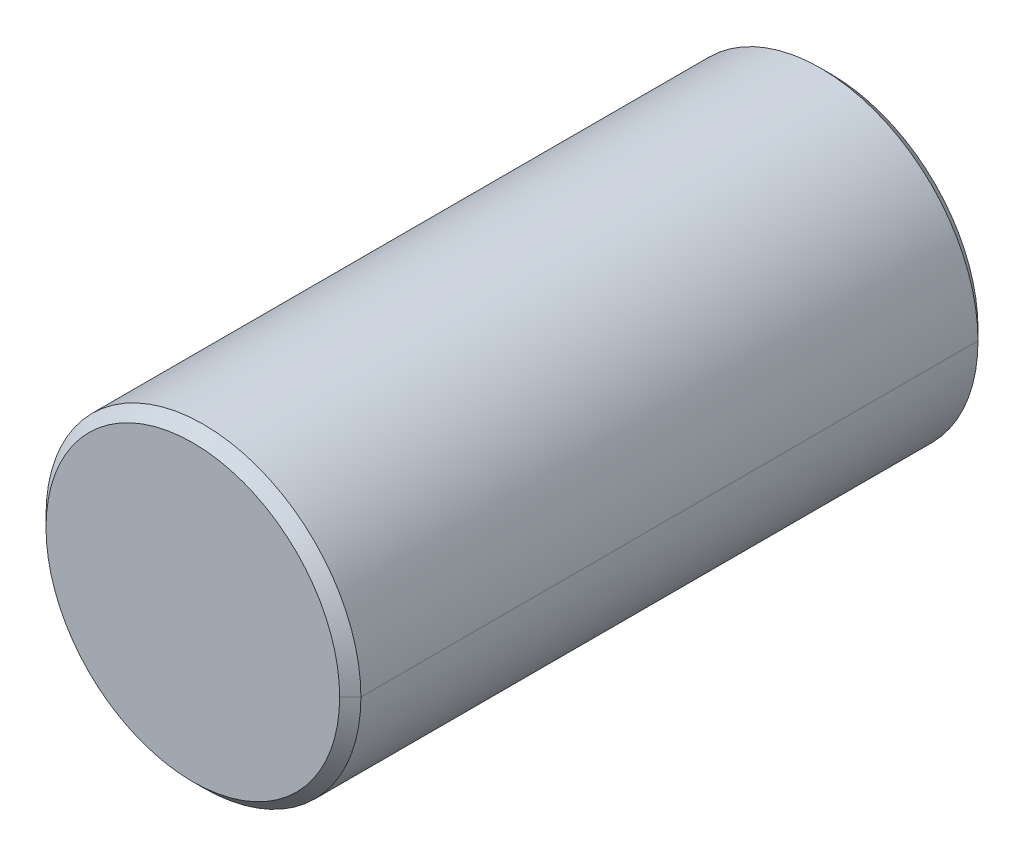
ISO-10303-21;
HEADER;
FILE_DESCRIPTION(('STEP AP214'),'2;1');
FILE_NAME('part.step','',(''),(''),'','','');
FILE_SCHEMA(('AUTOMOTIVE_DESIGN { 1 0 10303 214 1 1 1 1 }'));
ENDSEC;
DATA;
#1=APPLICATION_CONTEXT('core data for automotive mechanical design processes');
#2=APPLICATION_PROTOCOL_DEFINITION('international standard','automotive_design',2000,#1);
#3=PRODUCT_CONTEXT('',#1,'mechanical');
#4=PRODUCT('Part','Part','',(#3));
#5=PRODUCT_RELATED_PRODUCT_CATEGORY('part','',(#4));
#6=PRODUCT_DEFINITION_FORMATION('','',#4);
#7=PRODUCT_DEFINITION_CONTEXT('part definition',#1,'design');
#8=PRODUCT_DEFINITION('design','',#6,#7);
#9=PRODUCT_DEFINITION_SHAPE('','',#8);
#10=(LENGTH_UNIT() NAMED_UNIT(*) SI_UNIT(.MILLI.,.METRE.));
#11=(NAMED_UNIT(*) PLANE_ANGLE_UNIT() SI_UNIT($,.RADIAN.));
#12=(NAMED_UNIT(*) SI_UNIT($,.STERADIAN.) SOLID_ANGLE_UNIT());
#13=UNCERTAINTY_MEASURE_WITH_UNIT(LENGTH_MEASURE(1.E-05),#10,'distance_accuracy_value','');
#14=(GEOMETRIC_REPRESENTATION_CONTEXT(3) GLOBAL_UNCERTAINTY_ASSIGNED_CONTEXT((#13)) GLOBAL_UNIT_ASSIGNED_CONTEXT((#10,
#11,#12)) REPRESENTATION_CONTEXT('',''));
#15=CARTESIAN_POINT('',(0.,0.,0.));
#16=DIRECTION('',(0.,0.,1.));
#17=DIRECTION('',(1.,0.,0.));
#18=AXIS2_PLACEMENT_3D('',#15,#16,#17);
#19=CARTESIAN_POINT('',(0.,0.,-2.));
#20=DIRECTION('',(0.,0.,1.));
#21=DIRECTION('',(1.,0.,0.));
#22=AXIS2_PLACEMENT_3D('',#19,#20,#21);
#23=CYLINDRICAL_SURFACE('',#22,0.74);
#24=DIRECTION('',(0.,0.,-1.));
#25=VECTOR('',#24,1.);
#26=CARTESIAN_POINT('',(0.74,8.986054695829E-10,0.95));
#27=LINE('',#26,#25);
#28=CARTESIAN_POINT('',(0.74,0.,0.95));
#29=VERTEX_POINT('',#28);
#30=CARTESIAN_POINT('',(0.7400000000001,8.986052599583E-10,-1.95));
#31=VERTEX_POINT('',#30);
#32=EDGE_CURVE('E87',#29,#31,#27,.T.);
#33=ORIENTED_EDGE('',*,*,#32,.T.);
#34=CARTESIAN_POINT('',(0.,0.,-1.95));
#35=DIRECTION('',(0.,0.,1.));
#36=DIRECTION('',(1.,0.,0.));
#37=AXIS2_PLACEMENT_3D('',#34,#35,#36);
#38=CIRCLE('',#37,0.7400000000003);
#39=CARTESIAN_POINT('',(0.,0.7400000000003,-1.95));
#40=VERTEX_POINT('',#39);
#41=EDGE_CURVE('E157',#31,#40,#38,.T.);
#42=ORIENTED_EDGE('',*,*,#41,.T.);
#43=CARTESIAN_POINT('',(0.,0.,-1.95));
#44=DIRECTION('',(0.,0.,1.));
#45=DIRECTION('',(0.,1.,0.));
#46=AXIS2_PLACEMENT_3D('',#43,#44,#45);
#47=CIRCLE('',#46,0.7400000000003);
#48=CARTESIAN_POINT('',(-0.7400000000003,-1.547337145495E-09,-1.95));
#49=VERTEX_POINT('',#48);
#50=EDGE_CURVE('E161',#40,#49,#47,.T.);
#51=ORIENTED_EDGE('',*,*,#50,.T.);
#52=DIRECTION('',(0.,0.,-1.));
#53=VECTOR('',#52,1.);
#54=CARTESIAN_POINT('',(-0.74,-1.672273923329E-09,0.95));
#55=LINE('',#54,#53);
#56=CARTESIAN_POINT('',(-0.74,-1.547337145495E-09,0.95));
#57=VERTEX_POINT('',#56);
#58=EDGE_CURVE('E120',#57,#49,#55,.T.);
#59=ORIENTED_EDGE('',*,*,#58,.F.);
#60=CARTESIAN_POINT('',(0.,0.,0.95));
#61=DIRECTION('',(0.,0.,-1.));
#62=DIRECTION('',(-1.,-2.09099614256E-09,0.));
#63=AXIS2_PLACEMENT_3D('',#60,#61,#62);
#64=CIRCLE('',#63,0.74);
#65=CARTESIAN_POINT('',(0.,0.74,0.95));
#66=VERTEX_POINT('',#65);
#67=EDGE_CURVE('E11',#57,#66,#64,.T.);
#68=ORIENTED_EDGE('',*,*,#67,.T.);
#69=CARTESIAN_POINT('',(0.,0.,0.95));
#70=DIRECTION('',(0.,0.,-1.));
#71=DIRECTION('',(0.,1.,0.));
#72=AXIS2_PLACEMENT_3D('',#69,#70,#71);
#73=CIRCLE('',#72,0.74);
#74=EDGE_CURVE('E20',#66,#29,#73,.T.);
#75=ORIENTED_EDGE('',*,*,#74,.T.);
#76=EDGE_LOOP('',(#33,#42,#51,#59,#68,#75));
#77=FACE_BOUND('',#76,.T.);
#78=ADVANCED_FACE('F17',(#77),#23,.T.);
#79=CARTESIAN_POINT('',(0.,0.,0.975));
#80=DIRECTION('',(0.,0.,-1.));
#81=DIRECTION('',(0.,-1.,0.));
#82=AXIS2_PLACEMENT_3D('',#79,#80,#81);
#83=CONICAL_SURFACE('',#82,0.715,0.7853981633973);
#84=DIRECTION('',(-0.707106781186598,3.09118448420199E-09,0.707106781186498));
#85=VECTOR('',#84,1.);
#86=CARTESIAN_POINT('',(0.74,8.986054695829E-10,0.95));
#87=LINE('',#86,#85);
#88=CARTESIAN_POINT('',(0.69,0.,1.));
#89=VERTEX_POINT('',#88);
#90=EDGE_CURVE('E93',#29,#89,#87,.T.);
#91=ORIENTED_EDGE('',*,*,#90,.F.);
#92=ORIENTED_EDGE('',*,*,#74,.F.);
#93=ORIENTED_EDGE('',*,*,#67,.F.);
#94=DIRECTION('',(0.707106781186598,7.85014260544997E-09,0.707106781186498));
#95=VECTOR('',#94,1.);
#96=CARTESIAN_POINT('',(-0.74,-1.672273923329E-09,0.95));
#97=LINE('',#96,#95);
#98=CARTESIAN_POINT('',(-0.69,0.,1.));
#99=VERTEX_POINT('',#98);
#100=EDGE_CURVE('E103',#57,#99,#97,.T.);
#101=ORIENTED_EDGE('',*,*,#100,.T.);
#102=CARTESIAN_POINT('',(0.,0.,1.));
#103=DIRECTION('',(0.,0.,-1.));
#104=DIRECTION('',(-1.,0.,0.));
#105=AXIS2_PLACEMENT_3D('',#102,#103,#104);
#106=CIRCLE('',#105,0.69);
#107=CARTESIAN_POINT('',(0.,0.69,1.));
#108=VERTEX_POINT('',#107);
#109=EDGE_CURVE('E91',#99,#108,#106,.T.);
#110=ORIENTED_EDGE('',*,*,#109,.T.);
#111=CARTESIAN_POINT('',(0.,0.,1.));
#112=DIRECTION('',(0.,0.,-1.));
#113=DIRECTION('',(0.,1.,0.));
#114=AXIS2_PLACEMENT_3D('',#111,#112,#113);
#115=CIRCLE('',#114,0.69);
#116=EDGE_CURVE('E97',#108,#89,#115,.T.);
#117=ORIENTED_EDGE('',*,*,#116,.T.);
#118=EDGE_LOOP('',(#91,#92,#93,#101,#110,#117));
#119=FACE_BOUND('',#118,.T.);
#120=ADVANCED_FACE('F95',(#119),#83,.T.);
#121=CARTESIAN_POINT('',(0.,0.,1.));
#122=DIRECTION('',(0.,0.,1.));
#123=DIRECTION('',(1.,0.,0.));
#124=AXIS2_PLACEMENT_3D('',#121,#122,#123);
#125=PLANE('',#124);
#126=CARTESIAN_POINT('',(0.,0.,1.));
#127=DIRECTION('',(0.,0.,-1.));
#128=DIRECTION('',(0.,-1.,0.));
#129=AXIS2_PLACEMENT_3D('',#126,#127,#128);
#130=CIRCLE('',#129,0.69);
#131=CARTESIAN_POINT('',(0.,-0.69,1.));
#132=VERTEX_POINT('',#131);
#133=EDGE_CURVE('E131',#132,#99,#130,.T.);
#134=ORIENTED_EDGE('',*,*,#133,.F.);
#135=CARTESIAN_POINT('',(0.,0.,1.));
#136=DIRECTION('',(0.,0.,-1.));
#137=DIRECTION('',(1.,0.,0.));
#138=AXIS2_PLACEMENT_3D('',#135,#136,#137);
#139=CIRCLE('',#138,0.69);
#140=EDGE_CURVE('E102',#89,#132,#139,.T.);
#141=ORIENTED_EDGE('',*,*,#140,.F.);
#142=ORIENTED_EDGE('',*,*,#116,.F.);
#143=ORIENTED_EDGE('',*,*,#109,.F.);
#144=EDGE_LOOP('',(#134,#141,#142,#143));
#145=FACE_BOUND('',#144,.T.);
#146=ADVANCED_FACE('F214',(#145),#125,.T.);
#147=CARTESIAN_POINT('',(0.,0.,0.975));
#148=DIRECTION('',(0.,0.,-1.));
#149=DIRECTION('',(0.,-1.,0.));
#150=AXIS2_PLACEMENT_3D('',#147,#148,#149);
#151=CONICAL_SURFACE('',#150,0.715,0.7853981633973);
#152=ORIENTED_EDGE('',*,*,#100,.F.);
#153=CARTESIAN_POINT('',(0.,0.,0.95));
#154=DIRECTION('',(0.,0.,-1.));
#155=DIRECTION('',(0.,-1.,0.));
#156=AXIS2_PLACEMENT_3D('',#153,#154,#155);
#157=CIRCLE('',#156,0.74);
#158=CARTESIAN_POINT('',(0.,-0.74,0.95));
#159=VERTEX_POINT('',#158);
#160=EDGE_CURVE('E110',#159,#57,#157,.T.);
#161=ORIENTED_EDGE('',*,*,#160,.F.);
#162=CARTESIAN_POINT('',(0.,0.,0.95));
#163=DIRECTION('',(0.,0.,-1.));
#164=DIRECTION('',(1.,0.,0.));
#165=AXIS2_PLACEMENT_3D('',#162,#163,#164);
#166=CIRCLE('',#165,0.74);
#167=EDGE_CURVE('E106',#29,#159,#166,.T.);
#168=ORIENTED_EDGE('',*,*,#167,.F.);
#169=ORIENTED_EDGE('',*,*,#90,.T.);
#170=ORIENTED_EDGE('',*,*,#140,.T.);
#171=ORIENTED_EDGE('',*,*,#133,.T.);
#172=EDGE_LOOP('',(#152,#161,#168,#169,#170,#171));
#173=FACE_BOUND('',#172,.T.);
#174=ADVANCED_FACE('F108',(#173),#151,.T.);
#175=CARTESIAN_POINT('',(0.,0.,-2.));
#176=DIRECTION('',(0.,0.,1.));
#177=DIRECTION('',(1.,0.,0.));
#178=AXIS2_PLACEMENT_3D('',#175,#176,#177);
#179=CYLINDRICAL_SURFACE('',#178,0.74);
#180=ORIENTED_EDGE('',*,*,#58,.T.);
#181=CARTESIAN_POINT('',(0.,0.,-1.95));
#182=DIRECTION('',(0.,0.,1.));
#183=DIRECTION('',(-1.,-2.09099614256E-09,0.));
#184=AXIS2_PLACEMENT_3D('',#181,#182,#183);
#185=CIRCLE('',#184,0.7400000000003);
#186=CARTESIAN_POINT('',(0.,-0.7400000000003,-1.95));
#187=VERTEX_POINT('',#186);
#188=EDGE_CURVE('E126',#49,#187,#185,.T.);
#189=ORIENTED_EDGE('',*,*,#188,.T.);
#190=CARTESIAN_POINT('',(0.,0.,-1.95));
#191=DIRECTION('',(0.,0.,1.));
#192=DIRECTION('',(0.,-1.,0.));
#193=AXIS2_PLACEMENT_3D('',#190,#191,#192);
#194=CIRCLE('',#193,0.7400000000003);
#195=EDGE_CURVE('E117',#187,#31,#194,.T.);
#196=ORIENTED_EDGE('',*,*,#195,.T.);
#197=ORIENTED_EDGE('',*,*,#32,.F.);
#198=ORIENTED_EDGE('',*,*,#167,.T.);
#199=ORIENTED_EDGE('',*,*,#160,.T.);
#200=EDGE_LOOP('',(#180,#189,#196,#197,#198,#199));
#201=FACE_BOUND('',#200,.T.);
#202=ADVANCED_FACE('F115',(#201),#179,.T.);
#203=CARTESIAN_POINT('',(0.,0.,-1.975));
#204=DIRECTION('',(0.,0.,1.));
#205=DIRECTION('',(0.,-1.,0.));
#206=AXIS2_PLACEMENT_3D('',#203,#204,#205);
#207=CONICAL_SURFACE('',#206,0.7150000000002,0.7853981633973);
#208=DIRECTION('',(-0.707106781185998,3.09118416143799E-09,-0.707106781187098));
#209=VECTOR('',#208,1.);
#210=CARTESIAN_POINT('',(0.7400000000001,8.986052599583E-10,-1.95));
#211=LINE('',#210,#209);
#212=CARTESIAN_POINT('',(0.6900000000002,0.,-2.));
#213=VERTEX_POINT('',#212);
#214=EDGE_CURVE('E160',#31,#213,#211,.T.);
#215=ORIENTED_EDGE('',*,*,#214,.F.);
#216=ORIENTED_EDGE('',*,*,#195,.F.);
#217=ORIENTED_EDGE('',*,*,#188,.F.);
#218=DIRECTION('',(0.707106781185998,7.85014179774797E-09,-0.707106781187098));
#219=VECTOR('',#218,1.);
#220=CARTESIAN_POINT('',(-0.7400000000001,-1.672274042331E-09,-1.95));
#221=LINE('',#220,#219);
#222=CARTESIAN_POINT('',(-0.6900000000002,0.,-2.));
#223=VERTEX_POINT('',#222);
#224=EDGE_CURVE('E148',#49,#223,#221,.T.);
#225=ORIENTED_EDGE('',*,*,#224,.T.);
#226=CARTESIAN_POINT('',(0.,0.,-2.));
#227=DIRECTION('',(0.,0.,1.));
#228=DIRECTION('',(-1.,0.,0.));
#229=AXIS2_PLACEMENT_3D('',#226,#227,#228);
#230=CIRCLE('',#229,0.6900000000002);
#231=CARTESIAN_POINT('',(0.,-0.6900000000002,-2.));
#232=VERTEX_POINT('',#231);
#233=EDGE_CURVE('E156',#223,#232,#230,.T.);
#234=ORIENTED_EDGE('',*,*,#233,.T.);
#235=CARTESIAN_POINT('',(0.,0.,-2.));
#236=DIRECTION('',(0.,0.,1.));
#237=DIRECTION('',(0.,-1.,0.));
#238=AXIS2_PLACEMENT_3D('',#235,#236,#237);
#239=CIRCLE('',#238,0.6900000000002);
#240=EDGE_CURVE('E152',#232,#213,#239,.T.);
#241=ORIENTED_EDGE('',*,*,#240,.T.);
#242=EDGE_LOOP('',(#215,#216,#217,#225,#234,#241));
#243=FACE_BOUND('',#242,.T.);
#244=ADVANCED_FACE('F187',(#243),#207,.T.);
#245=CARTESIAN_POINT('',(0.,0.,-1.975));
#246=DIRECTION('',(0.,0.,1.));
#247=DIRECTION('',(0.,-1.,0.));
#248=AXIS2_PLACEMENT_3D('',#245,#246,#247);
#249=CONICAL_SURFACE('',#248,0.7150000000002,0.7853981633973);
#250=ORIENTED_EDGE('',*,*,#224,.F.);
#251=ORIENTED_EDGE('',*,*,#50,.F.);
#252=ORIENTED_EDGE('',*,*,#41,.F.);
#253=ORIENTED_EDGE('',*,*,#214,.T.);
#254=CARTESIAN_POINT('',(0.,0.,-2.));
#255=DIRECTION('',(0.,0.,1.));
#256=DIRECTION('',(1.,0.,0.));
#257=AXIS2_PLACEMENT_3D('',#254,#255,#256);
#258=CIRCLE('',#257,0.6900000000002);
#259=CARTESIAN_POINT('',(0.,0.6900000000002,-2.));
#260=VERTEX_POINT('',#259);
#261=EDGE_CURVE('E144',#213,#260,#258,.T.);
#262=ORIENTED_EDGE('',*,*,#261,.T.);
#263=CARTESIAN_POINT('',(0.,0.,-2.));
#264=DIRECTION('',(0.,0.,1.));
#265=DIRECTION('',(0.,1.,0.));
#266=AXIS2_PLACEMENT_3D('',#263,#264,#265);
#267=CIRCLE('',#266,0.6900000000002);
#268=EDGE_CURVE('E149',#260,#223,#267,.T.);
#269=ORIENTED_EDGE('',*,*,#268,.T.);
#270=EDGE_LOOP('',(#250,#251,#252,#253,#262,#269));
#271=FACE_BOUND('',#270,.T.);
#272=ADVANCED_FACE('F188',(#271),#249,.T.);
#273=CARTESIAN_POINT('',(0.,0.,-2.));
#274=DIRECTION('',(0.,0.,1.));
#275=DIRECTION('',(1.,0.,0.));
#276=AXIS2_PLACEMENT_3D('',#273,#274,#275);
#277=PLANE('',#276);
#278=ORIENTED_EDGE('',*,*,#240,.F.);
#279=ORIENTED_EDGE('',*,*,#233,.F.);
#280=ORIENTED_EDGE('',*,*,#268,.F.);
#281=ORIENTED_EDGE('',*,*,#261,.F.);
#282=EDGE_LOOP('',(#278,#279,#280,#281));
#283=FACE_BOUND('',#282,.T.);
#284=ADVANCED_FACE('F232',(#283),#277,.F.);
#285=CLOSED_SHELL('',(#78,#120,#146,#174,#202,#244,#272,#284));
#286=MANIFOLD_SOLID_BREP('B1',#285);
#287=ADVANCED_BREP_SHAPE_REPRESENTATION('',(#18,#286),#14);
#288=SHAPE_DEFINITION_REPRESENTATION(#9,#287);
ENDSEC;
END-ISO-10303-21;
